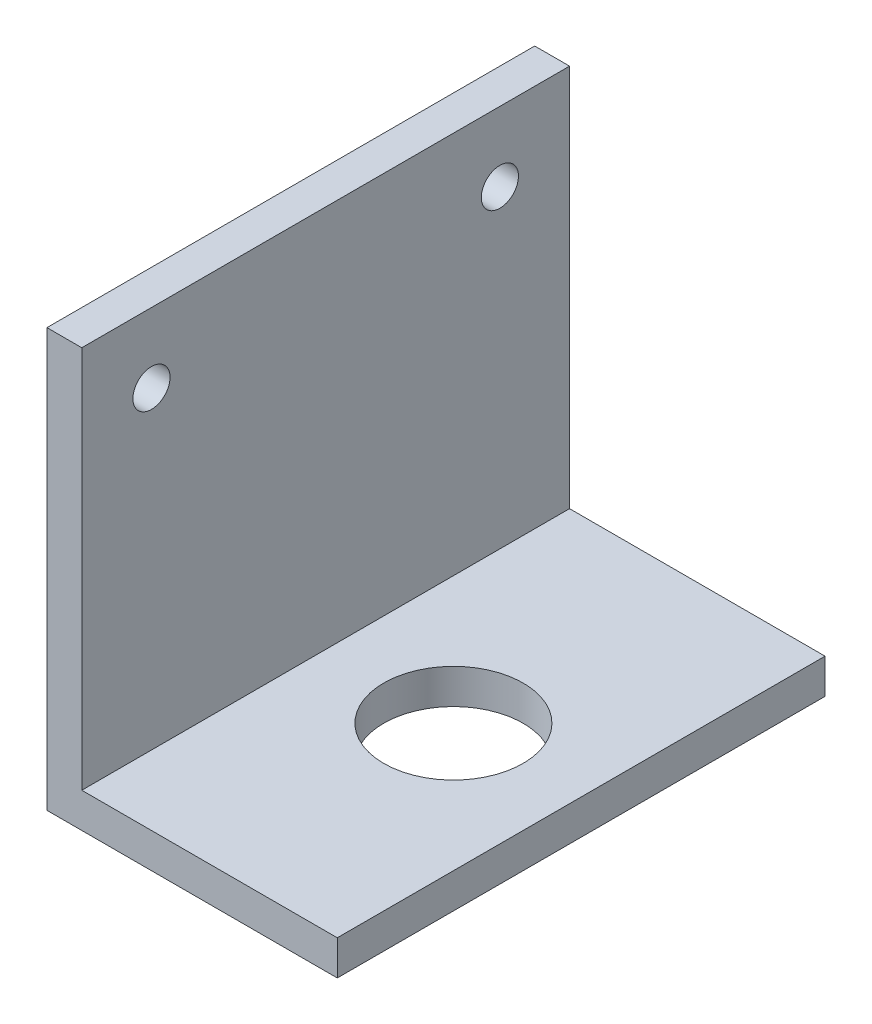
ISO-10303-21;
HEADER;
FILE_DESCRIPTION(('STEP AP214'),'2;1');
FILE_NAME('part.step','',(''),(''),'','','');
FILE_SCHEMA(('AUTOMOTIVE_DESIGN { 1 0 10303 214 1 1 1 1 }'));
ENDSEC;
DATA;
#1=APPLICATION_CONTEXT('core data for automotive mechanical design processes');
#2=APPLICATION_PROTOCOL_DEFINITION('international standard','automotive_design',2000,#1);
#3=PRODUCT_CONTEXT('',#1,'mechanical');
#4=PRODUCT('Part','Part','',(#3));
#5=PRODUCT_RELATED_PRODUCT_CATEGORY('part','',(#4));
#6=PRODUCT_DEFINITION_FORMATION('','',#4);
#7=PRODUCT_DEFINITION_CONTEXT('part definition',#1,'design');
#8=PRODUCT_DEFINITION('design','',#6,#7);
#9=PRODUCT_DEFINITION_SHAPE('','',#8);
#10=(LENGTH_UNIT() NAMED_UNIT(*) SI_UNIT(.MILLI.,.METRE.));
#11=(NAMED_UNIT(*) PLANE_ANGLE_UNIT() SI_UNIT($,.RADIAN.));
#12=(NAMED_UNIT(*) SI_UNIT($,.STERADIAN.) SOLID_ANGLE_UNIT());
#13=UNCERTAINTY_MEASURE_WITH_UNIT(LENGTH_MEASURE(1.E-05),#10,'distance_accuracy_value','');
#14=(GEOMETRIC_REPRESENTATION_CONTEXT(3) GLOBAL_UNCERTAINTY_ASSIGNED_CONTEXT((#13)) GLOBAL_UNIT_ASSIGNED_CONTEXT((#10,
#11,#12)) REPRESENTATION_CONTEXT('',''));
#15=CARTESIAN_POINT('',(0.,0.,0.));
#16=DIRECTION('',(0.,0.,1.));
#17=DIRECTION('',(1.,0.,0.));
#18=AXIS2_PLACEMENT_3D('',#15,#16,#17);
#19=CARTESIAN_POINT('',(25.,0.,42.));
#20=DIRECTION('',(0.,1.,0.));
#21=DIRECTION('',(-1.,0.,0.));
#22=AXIS2_PLACEMENT_3D('',#19,#20,#21);
#23=PLANE('',#22);
#24=CARTESIAN_POINT('',(14.,0.,21.));
#25=DIRECTION('',(0.,1.,0.));
#26=DIRECTION('',(0.,0.,1.));
#27=AXIS2_PLACEMENT_3D('',#24,#25,#26);
#28=CIRCLE('',#27,6.);
#29=CARTESIAN_POINT('',(14.,0.,27.));
#30=VERTEX_POINT('',#29);
#31=EDGE_CURVE('E165',#30,#30,#28,.T.);
#32=ORIENTED_EDGE('',*,*,#31,.T.);
#33=EDGE_LOOP('',(#32));
#34=FACE_BOUND('',#33,.T.);
#35=DIRECTION('',(1.,0.,0.));
#36=VECTOR('',#35,1.);
#37=CARTESIAN_POINT('',(25.,0.,0.));
#38=LINE('',#37,#36);
#39=CARTESIAN_POINT('',(0.,0.,0.));
#40=VERTEX_POINT('',#39);
#41=CARTESIAN_POINT('',(25.,0.,0.));
#42=VERTEX_POINT('',#41);
#43=EDGE_CURVE('E120',#40,#42,#38,.T.);
#44=ORIENTED_EDGE('',*,*,#43,.T.);
#45=DIRECTION('',(0.,0.,-1.));
#46=VECTOR('',#45,1.);
#47=CARTESIAN_POINT('',(25.,0.,42.));
#48=LINE('',#47,#46);
#49=CARTESIAN_POINT('',(25.,0.,42.));
#50=VERTEX_POINT('',#49);
#51=EDGE_CURVE('E11',#50,#42,#48,.T.);
#52=ORIENTED_EDGE('',*,*,#51,.F.);
#53=DIRECTION('',(1.,0.,0.));
#54=VECTOR('',#53,1.);
#55=CARTESIAN_POINT('',(25.,0.,42.));
#56=LINE('',#55,#54);
#57=CARTESIAN_POINT('',(0.,0.,42.));
#58=VERTEX_POINT('',#57);
#59=EDGE_CURVE('E131',#58,#50,#56,.T.);
#60=ORIENTED_EDGE('',*,*,#59,.F.);
#61=DIRECTION('',(0.,0.,-1.));
#62=VECTOR('',#61,1.);
#63=CARTESIAN_POINT('',(0.,0.,42.));
#64=LINE('',#63,#62);
#65=EDGE_CURVE('E116',#58,#40,#64,.T.);
#66=ORIENTED_EDGE('',*,*,#65,.T.);
#67=EDGE_LOOP('',(#44,#52,#60,#66));
#68=FACE_BOUND('',#67,.T.);
#69=ADVANCED_FACE('F36',(#34,#68),#23,.F.);
#70=CARTESIAN_POINT('',(25.,3.,42.));
#71=DIRECTION('',(-1.,0.,0.));
#72=DIRECTION('',(0.,0.,1.));
#73=AXIS2_PLACEMENT_3D('',#70,#71,#72);
#74=PLANE('',#73);
#75=DIRECTION('',(0.,1.,0.));
#76=VECTOR('',#75,1.);
#77=CARTESIAN_POINT('',(25.,3.,0.));
#78=LINE('',#77,#76);
#79=CARTESIAN_POINT('',(25.,3.,0.));
#80=VERTEX_POINT('',#79);
#81=EDGE_CURVE('E123',#42,#80,#78,.T.);
#82=ORIENTED_EDGE('',*,*,#81,.T.);
#83=DIRECTION('',(0.,0.,-1.));
#84=VECTOR('',#83,1.);
#85=CARTESIAN_POINT('',(25.,3.,42.));
#86=LINE('',#85,#84);
#87=CARTESIAN_POINT('',(25.,3.,42.));
#88=VERTEX_POINT('',#87);
#89=EDGE_CURVE('E44',#88,#80,#86,.T.);
#90=ORIENTED_EDGE('',*,*,#89,.F.);
#91=DIRECTION('',(0.,1.,0.));
#92=VECTOR('',#91,1.);
#93=CARTESIAN_POINT('',(25.,3.,42.));
#94=LINE('',#93,#92);
#95=EDGE_CURVE('E89',#50,#88,#94,.T.);
#96=ORIENTED_EDGE('',*,*,#95,.F.);
#97=ORIENTED_EDGE('',*,*,#51,.T.);
#98=EDGE_LOOP('',(#82,#90,#96,#97));
#99=FACE_BOUND('',#98,.T.);
#100=ADVANCED_FACE('F158',(#99),#74,.F.);
#101=CARTESIAN_POINT('',(3.,3.,42.));
#102=DIRECTION('',(0.,-1.,0.));
#103=DIRECTION('',(0.,0.,-1.));
#104=AXIS2_PLACEMENT_3D('',#101,#102,#103);
#105=PLANE('',#104);
#106=CARTESIAN_POINT('',(14.,3.,21.));
#107=DIRECTION('',(0.,1.,0.));
#108=DIRECTION('',(0.,0.,1.));
#109=AXIS2_PLACEMENT_3D('',#106,#107,#108);
#110=CIRCLE('',#109,6.);
#111=CARTESIAN_POINT('',(14.,3.,27.));
#112=VERTEX_POINT('',#111);
#113=EDGE_CURVE('E168',#112,#112,#110,.T.);
#114=ORIENTED_EDGE('',*,*,#113,.F.);
#115=EDGE_LOOP('',(#114));
#116=FACE_BOUND('',#115,.T.);
#117=DIRECTION('',(-1.,0.,0.));
#118=VECTOR('',#117,1.);
#119=CARTESIAN_POINT('',(3.,3.,0.));
#120=LINE('',#119,#118);
#121=CARTESIAN_POINT('',(3.,3.,0.));
#122=VERTEX_POINT('',#121);
#123=EDGE_CURVE('E126',#80,#122,#120,.T.);
#124=ORIENTED_EDGE('',*,*,#123,.T.);
#125=DIRECTION('',(0.,0.,-1.));
#126=VECTOR('',#125,1.);
#127=CARTESIAN_POINT('',(3.,3.,42.));
#128=LINE('',#127,#126);
#129=CARTESIAN_POINT('',(3.,3.,42.));
#130=VERTEX_POINT('',#129);
#131=EDGE_CURVE('E111',#130,#122,#128,.T.);
#132=ORIENTED_EDGE('',*,*,#131,.F.);
#133=DIRECTION('',(-1.,0.,0.));
#134=VECTOR('',#133,1.);
#135=CARTESIAN_POINT('',(3.,3.,42.));
#136=LINE('',#135,#134);
#137=EDGE_CURVE('E102',#88,#130,#136,.T.);
#138=ORIENTED_EDGE('',*,*,#137,.F.);
#139=ORIENTED_EDGE('',*,*,#89,.T.);
#140=EDGE_LOOP('',(#124,#132,#138,#139));
#141=FACE_BOUND('',#140,.T.);
#142=ADVANCED_FACE('F137',(#116,#141),#105,.F.);
#143=CARTESIAN_POINT('',(3.,36.,42.));
#144=DIRECTION('',(-1.,0.,0.));
#145=DIRECTION('',(0.,-1.,0.));
#146=AXIS2_PLACEMENT_3D('',#143,#144,#145);
#147=PLANE('',#146);
#148=CARTESIAN_POINT('',(3.,30.,36.));
#149=DIRECTION('',(-1.,0.,0.));
#150=DIRECTION('',(0.,-1.,0.));
#151=AXIS2_PLACEMENT_3D('',#148,#149,#150);
#152=CIRCLE('',#151,1.6);
#153=CARTESIAN_POINT('',(3.,28.4,36.));
#154=VERTEX_POINT('',#153);
#155=EDGE_CURVE('E124',#154,#154,#152,.T.);
#156=ORIENTED_EDGE('',*,*,#155,.T.);
#157=EDGE_LOOP('',(#156));
#158=FACE_BOUND('',#157,.T.);
#159=CARTESIAN_POINT('',(3.,30.,6.));
#160=DIRECTION('',(-1.,0.,0.));
#161=DIRECTION('',(0.,-1.,0.));
#162=AXIS2_PLACEMENT_3D('',#159,#160,#161);
#163=CIRCLE('',#162,1.6);
#164=CARTESIAN_POINT('',(3.,28.4,6.));
#165=VERTEX_POINT('',#164);
#166=EDGE_CURVE('E177',#165,#165,#163,.T.);
#167=ORIENTED_EDGE('',*,*,#166,.T.);
#168=EDGE_LOOP('',(#167));
#169=FACE_BOUND('',#168,.T.);
#170=DIRECTION('',(0.,1.,0.));
#171=VECTOR('',#170,1.);
#172=CARTESIAN_POINT('',(3.,36.,0.));
#173=LINE('',#172,#171);
#174=CARTESIAN_POINT('',(3.,36.,0.));
#175=VERTEX_POINT('',#174);
#176=EDGE_CURVE('E110',#122,#175,#173,.T.);
#177=ORIENTED_EDGE('',*,*,#176,.T.);
#178=DIRECTION('',(0.,0.,-1.));
#179=VECTOR('',#178,1.);
#180=CARTESIAN_POINT('',(3.,36.,42.));
#181=LINE('',#180,#179);
#182=CARTESIAN_POINT('',(3.,36.,42.));
#183=VERTEX_POINT('',#182);
#184=EDGE_CURVE('E107',#183,#175,#181,.T.);
#185=ORIENTED_EDGE('',*,*,#184,.F.);
#186=DIRECTION('',(0.,1.,0.));
#187=VECTOR('',#186,1.);
#188=CARTESIAN_POINT('',(3.,36.,42.));
#189=LINE('',#188,#187);
#190=EDGE_CURVE('E96',#130,#183,#189,.T.);
#191=ORIENTED_EDGE('',*,*,#190,.F.);
#192=ORIENTED_EDGE('',*,*,#131,.T.);
#193=EDGE_LOOP('',(#177,#185,#191,#192));
#194=FACE_BOUND('',#193,.T.);
#195=ADVANCED_FACE('F108',(#158,#169,#194),#147,.F.);
#196=CARTESIAN_POINT('',(0.,36.,42.));
#197=DIRECTION('',(0.,-1.,0.));
#198=DIRECTION('',(0.,0.,-1.));
#199=AXIS2_PLACEMENT_3D('',#196,#197,#198);
#200=PLANE('',#199);
#201=DIRECTION('',(-1.,0.,0.));
#202=VECTOR('',#201,1.);
#203=CARTESIAN_POINT('',(0.,36.,0.));
#204=LINE('',#203,#202);
#205=CARTESIAN_POINT('',(0.,36.,0.));
#206=VERTEX_POINT('',#205);
#207=EDGE_CURVE('E75',#175,#206,#204,.T.);
#208=ORIENTED_EDGE('',*,*,#207,.T.);
#209=DIRECTION('',(0.,0.,-1.));
#210=VECTOR('',#209,1.);
#211=CARTESIAN_POINT('',(0.,36.,42.));
#212=LINE('',#211,#210);
#213=CARTESIAN_POINT('',(0.,36.,42.));
#214=VERTEX_POINT('',#213);
#215=EDGE_CURVE('E112',#214,#206,#212,.T.);
#216=ORIENTED_EDGE('',*,*,#215,.F.);
#217=DIRECTION('',(-1.,0.,0.));
#218=VECTOR('',#217,1.);
#219=CARTESIAN_POINT('',(0.,36.,42.));
#220=LINE('',#219,#218);
#221=EDGE_CURVE('E100',#183,#214,#220,.T.);
#222=ORIENTED_EDGE('',*,*,#221,.F.);
#223=ORIENTED_EDGE('',*,*,#184,.T.);
#224=EDGE_LOOP('',(#208,#216,#222,#223));
#225=FACE_BOUND('',#224,.T.);
#226=ADVANCED_FACE('F114',(#225),#200,.F.);
#227=CARTESIAN_POINT('',(0.,0.,42.));
#228=DIRECTION('',(1.,0.,0.));
#229=DIRECTION('',(0.,0.,-1.));
#230=AXIS2_PLACEMENT_3D('',#227,#228,#229);
#231=PLANE('',#230);
#232=CARTESIAN_POINT('',(0.,30.,36.));
#233=DIRECTION('',(-1.,0.,0.));
#234=DIRECTION('',(0.,0.,1.));
#235=AXIS2_PLACEMENT_3D('',#232,#233,#234);
#236=CIRCLE('',#235,1.6);
#237=CARTESIAN_POINT('',(0.,30.,37.6));
#238=VERTEX_POINT('',#237);
#239=EDGE_CURVE('E171',#238,#238,#236,.T.);
#240=ORIENTED_EDGE('',*,*,#239,.F.);
#241=EDGE_LOOP('',(#240));
#242=FACE_BOUND('',#241,.T.);
#243=CARTESIAN_POINT('',(0.,30.,6.));
#244=DIRECTION('',(-1.,0.,0.));
#245=DIRECTION('',(0.,0.,1.));
#246=AXIS2_PLACEMENT_3D('',#243,#244,#245);
#247=CIRCLE('',#246,1.6);
#248=CARTESIAN_POINT('',(0.,30.,7.6));
#249=VERTEX_POINT('',#248);
#250=EDGE_CURVE('E167',#249,#249,#247,.T.);
#251=ORIENTED_EDGE('',*,*,#250,.F.);
#252=EDGE_LOOP('',(#251));
#253=FACE_BOUND('',#252,.T.);
#254=DIRECTION('',(0.,-1.,0.));
#255=VECTOR('',#254,1.);
#256=CARTESIAN_POINT('',(0.,0.,0.));
#257=LINE('',#256,#255);
#258=EDGE_CURVE('E81',#206,#40,#257,.T.);
#259=ORIENTED_EDGE('',*,*,#258,.T.);
#260=ORIENTED_EDGE('',*,*,#65,.F.);
#261=DIRECTION('',(0.,-1.,0.));
#262=VECTOR('',#261,1.);
#263=CARTESIAN_POINT('',(0.,0.,42.));
#264=LINE('',#263,#262);
#265=EDGE_CURVE('E52',#214,#58,#264,.T.);
#266=ORIENTED_EDGE('',*,*,#265,.F.);
#267=ORIENTED_EDGE('',*,*,#215,.T.);
#268=EDGE_LOOP('',(#259,#260,#266,#267));
#269=FACE_BOUND('',#268,.T.);
#270=ADVANCED_FACE('F144',(#242,#253,#269),#231,.F.);
#271=CARTESIAN_POINT('',(0.,0.,42.));
#272=DIRECTION('',(0.,0.,-1.));
#273=DIRECTION('',(-1.,0.,0.));
#274=AXIS2_PLACEMENT_3D('',#271,#272,#273);
#275=PLANE('',#274);
#276=ORIENTED_EDGE('',*,*,#59,.T.);
#277=ORIENTED_EDGE('',*,*,#95,.T.);
#278=ORIENTED_EDGE('',*,*,#137,.T.);
#279=ORIENTED_EDGE('',*,*,#190,.T.);
#280=ORIENTED_EDGE('',*,*,#221,.T.);
#281=ORIENTED_EDGE('',*,*,#265,.T.);
#282=EDGE_LOOP('',(#276,#277,#278,#279,#280,#281));
#283=FACE_BOUND('',#282,.T.);
#284=ADVANCED_FACE('F98',(#283),#275,.F.);
#285=CARTESIAN_POINT('',(0.,0.,0.));
#286=DIRECTION('',(0.,0.,-1.));
#287=DIRECTION('',(-1.,0.,0.));
#288=AXIS2_PLACEMENT_3D('',#285,#286,#287);
#289=PLANE('',#288);
#290=ORIENTED_EDGE('',*,*,#43,.F.);
#291=ORIENTED_EDGE('',*,*,#258,.F.);
#292=ORIENTED_EDGE('',*,*,#207,.F.);
#293=ORIENTED_EDGE('',*,*,#176,.F.);
#294=ORIENTED_EDGE('',*,*,#123,.F.);
#295=ORIENTED_EDGE('',*,*,#81,.F.);
#296=EDGE_LOOP('',(#290,#291,#292,#293,#294,#295));
#297=FACE_BOUND('',#296,.T.);
#298=ADVANCED_FACE('F140',(#297),#289,.T.);
#299=CARTESIAN_POINT('',(25.,30.,6.));
#300=DIRECTION('',(-1.,0.,0.));
#301=DIRECTION('',(0.,0.,1.));
#302=AXIS2_PLACEMENT_3D('',#299,#300,#301);
#303=CYLINDRICAL_SURFACE('',#302,1.6);
#304=ORIENTED_EDGE('',*,*,#250,.T.);
#305=EDGE_LOOP('',(#304));
#306=FACE_BOUND('',#305,.T.);
#307=ORIENTED_EDGE('',*,*,#166,.F.);
#308=EDGE_LOOP('',(#307));
#309=FACE_BOUND('',#308,.T.);
#310=ADVANCED_FACE('F191',(#306,#309),#303,.F.);
#311=CARTESIAN_POINT('',(25.,30.,36.));
#312=DIRECTION('',(-1.,0.,0.));
#313=DIRECTION('',(0.,0.,1.));
#314=AXIS2_PLACEMENT_3D('',#311,#312,#313);
#315=CYLINDRICAL_SURFACE('',#314,1.6);
#316=ORIENTED_EDGE('',*,*,#239,.T.);
#317=EDGE_LOOP('',(#316));
#318=FACE_BOUND('',#317,.T.);
#319=ORIENTED_EDGE('',*,*,#155,.F.);
#320=EDGE_LOOP('',(#319));
#321=FACE_BOUND('',#320,.T.);
#322=ADVANCED_FACE('F188',(#318,#321),#315,.F.);
#323=CARTESIAN_POINT('',(14.,0.,21.));
#324=DIRECTION('',(0.,1.,0.));
#325=DIRECTION('',(0.,0.,1.));
#326=AXIS2_PLACEMENT_3D('',#323,#324,#325);
#327=CYLINDRICAL_SURFACE('',#326,6.);
#328=ORIENTED_EDGE('',*,*,#31,.F.);
#329=EDGE_LOOP('',(#328));
#330=FACE_BOUND('',#329,.T.);
#331=ORIENTED_EDGE('',*,*,#113,.T.);
#332=EDGE_LOOP('',(#331));
#333=FACE_BOUND('',#332,.T.);
#334=ADVANCED_FACE('F190',(#330,#333),#327,.F.);
#335=CLOSED_SHELL('',(#69,#100,#142,#195,#226,#270,#284,#298,#310,#322,#334));
#336=MANIFOLD_SOLID_BREP('B2',#335);
#337=ADVANCED_BREP_SHAPE_REPRESENTATION('',(#18,#336),#14);
#338=SHAPE_DEFINITION_REPRESENTATION(#9,#337);
ENDSEC;
END-ISO-10303-21;
